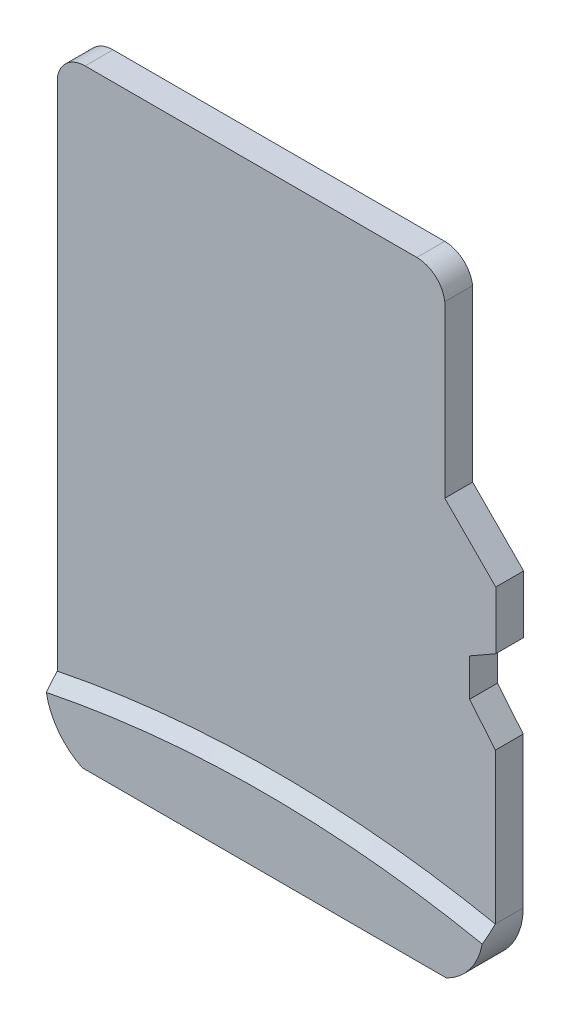
ISO-10303-21;
HEADER;
FILE_DESCRIPTION(('STEP AP214'),'2;1');
FILE_NAME('part.step','',(''),(''),'','','');
FILE_SCHEMA(('AUTOMOTIVE_DESIGN { 1 0 10303 214 1 1 1 1 }'));
ENDSEC;
DATA;
#1=APPLICATION_CONTEXT('core data for automotive mechanical design processes');
#2=APPLICATION_PROTOCOL_DEFINITION('international standard','automotive_design',2000,#1);
#3=PRODUCT_CONTEXT('',#1,'mechanical');
#4=PRODUCT('Part','Part','',(#3));
#5=PRODUCT_RELATED_PRODUCT_CATEGORY('part','',(#4));
#6=PRODUCT_DEFINITION_FORMATION('','',#4);
#7=PRODUCT_DEFINITION_CONTEXT('part definition',#1,'design');
#8=PRODUCT_DEFINITION('design','',#6,#7);
#9=PRODUCT_DEFINITION_SHAPE('','',#8);
#10=(LENGTH_UNIT() NAMED_UNIT(*) SI_UNIT(.MILLI.,.METRE.));
#11=(NAMED_UNIT(*) PLANE_ANGLE_UNIT() SI_UNIT($,.RADIAN.));
#12=(NAMED_UNIT(*) SI_UNIT($,.STERADIAN.) SOLID_ANGLE_UNIT());
#13=UNCERTAINTY_MEASURE_WITH_UNIT(LENGTH_MEASURE(1.E-05),#10,'distance_accuracy_value','');
#14=(GEOMETRIC_REPRESENTATION_CONTEXT(3) GLOBAL_UNCERTAINTY_ASSIGNED_CONTEXT((#13)) GLOBAL_UNIT_ASSIGNED_CONTEXT((#10,
#11,#12)) REPRESENTATION_CONTEXT('',''));
#15=CARTESIAN_POINT('',(0.,0.,0.));
#16=DIRECTION('',(0.,0.,1.));
#17=DIRECTION('',(1.,0.,0.));
#18=AXIS2_PLACEMENT_3D('',#15,#16,#17);
#19=CARTESIAN_POINT('',(23.959933723224,1.91827990787177,0.7));
#20=DIRECTION('',(0.,0.,1.));
#21=DIRECTION('',(1.,0.,0.));
#22=AXIS2_PLACEMENT_3D('',#19,#20,#21);
#23=PLANE('',#22);
#24=DIRECTION('',(2.81346803077018E-13,-1.,0.));
#25=VECTOR('',#24,1.);
#26=CARTESIAN_POINT('',(18.4539327369667,1.91827990787022,0.7));
#27=LINE('',#26,#25);
#28=CARTESIAN_POINT('',(18.4539327369607,23.4203809199612,0.7));
#29=VERTEX_POINT('',#28);
#30=CARTESIAN_POINT('',(18.4539327369643,10.5215618395466,0.7));
#31=VERTEX_POINT('',#30);
#32=EDGE_CURVE('E298',#29,#31,#27,.T.);
#33=ORIENTED_EDGE('',*,*,#32,.T.);
#34=CARTESIAN_POINT('',(23.9545115150179,-16.6696035780589,0.7));
#35=DIRECTION('',(0.,0.,1.));
#36=DIRECTION('',(1.,0.,0.));
#37=AXIS2_PLACEMENT_3D('',#34,#35,#36);
#38=CIRCLE('',#37,27.7419509707079);
#39=CARTESIAN_POINT('',(29.45509029309,10.5215618395429,0.7));
#40=VERTEX_POINT('',#39);
#41=EDGE_CURVE('E187',#31,#40,#38,.F.);
#42=ORIENTED_EDGE('',*,*,#41,.T.);
#43=DIRECTION('',(0.,-1.,0.));
#44=VECTOR('',#43,1.);
#45=CARTESIAN_POINT('',(29.45509029309,1.91827990787177,0.7));
#46=LINE('',#45,#44);
#47=CARTESIAN_POINT('',(29.45509029309,14.3034538287921,0.7));
#48=VERTEX_POINT('',#47);
#49=EDGE_CURVE('E300',#48,#40,#46,.T.);
#50=ORIENTED_EDGE('',*,*,#49,.F.);
#51=DIRECTION('',(0.635619317800836,-0.77200264432086,0.));
#52=VECTOR('',#51,1.);
#53=CARTESIAN_POINT('',(33.3123838453767,9.61850996555319,0.7));
#54=LINE('',#53,#52);
#55=CARTESIAN_POINT('',(28.8096789808155,15.0873495125709,0.7));
#56=VERTEX_POINT('',#55);
#57=EDGE_CURVE('E305',#56,#48,#54,.T.);
#58=ORIENTED_EDGE('',*,*,#57,.F.);
#59=DIRECTION('',(0.,-1.,0.));
#60=VECTOR('',#59,1.);
#61=CARTESIAN_POINT('',(28.8096789808155,1.91827990787177,0.7));
#62=LINE('',#61,#60);
#63=CARTESIAN_POINT('',(28.8096789808155,16.0307991680805,0.7));
#64=VERTEX_POINT('',#63);
#65=EDGE_CURVE('E312',#64,#56,#62,.T.);
#66=ORIENTED_EDGE('',*,*,#65,.F.);
#67=DIRECTION('',(0.868480025401258,0.495724162694366,0.));
#68=VECTOR('',#67,1.);
#69=CARTESIAN_POINT('',(19.075907988012,10.4748101595401,0.7));
#70=LINE('',#69,#68);
#71=CARTESIAN_POINT('',(29.4659653337916,16.4054042174787,0.7));
#72=VERTEX_POINT('',#71);
#73=EDGE_CURVE('E315',#64,#72,#70,.T.);
#74=ORIENTED_EDGE('',*,*,#73,.T.);
#75=DIRECTION('',(0.,-1.,0.));
#76=VECTOR('',#75,1.);
#77=CARTESIAN_POINT('',(29.4659653337916,1.91827990787177,0.7));
#78=LINE('',#77,#76);
#79=CARTESIAN_POINT('',(29.4659653337916,17.8560411369481,0.7));
#80=VERTEX_POINT('',#79);
#81=EDGE_CURVE('E174',#80,#72,#78,.T.);
#82=ORIENTED_EDGE('',*,*,#81,.F.);
#83=DIRECTION('',(0.704184265540735,-0.710017267511753,0.));
#84=VECTOR('',#83,1.);
#85=CARTESIAN_POINT('',(34.7042687489594,12.5743470417543,0.7));
#86=LINE('',#85,#84);
#87=CARTESIAN_POINT('',(28.1850891034887,19.147527308344,0.7));
#88=VERTEX_POINT('',#87);
#89=EDGE_CURVE('E160',#88,#80,#86,.T.);
#90=ORIENTED_EDGE('',*,*,#89,.F.);
#91=DIRECTION('',(-8.54196872922178E-13,-1.,0.));
#92=VECTOR('',#91,1.);
#93=CARTESIAN_POINT('',(28.185089103474,1.91827990786816,0.7));
#94=LINE('',#93,#92);
#95=CARTESIAN_POINT('',(28.1850891034923,23.4203809199116,0.7));
#96=VERTEX_POINT('',#95);
#97=EDGE_CURVE('E172',#96,#88,#94,.T.);
#98=ORIENTED_EDGE('',*,*,#97,.F.);
#99=CARTESIAN_POINT('',(27.4859645810288,23.3283197349789,0.7));
#100=DIRECTION('',(0.,0.,1.));
#101=DIRECTION('',(1.,0.,0.));
#102=AXIS2_PLACEMENT_3D('',#99,#100,#101);
#103=CIRCLE('',#102,0.705159811449334);
#104=CARTESIAN_POINT('',(27.4834451154169,24.0334750455159,0.7));
#105=VERTEX_POINT('',#104);
#106=EDGE_CURVE('E61',#96,#105,#103,.T.);
#107=ORIENTED_EDGE('',*,*,#106,.T.);
#108=DIRECTION('',(0.999999999999854,-5.40305386818244E-07,0.));
#109=VECTOR('',#108,1.);
#110=CARTESIAN_POINT('',(23.9599456721841,24.0334769492816,0.7));
#111=LINE('',#110,#109);
#112=CARTESIAN_POINT('',(19.1530572594242,24.0334795464693,0.7));
#113=VERTEX_POINT('',#112);
#114=EDGE_CURVE('E220',#113,#105,#111,.T.);
#115=ORIENTED_EDGE('',*,*,#114,.F.);
#116=CARTESIAN_POINT('',(19.1530572594242,23.3283197350216,0.7));
#117=DIRECTION('',(0.,0.,1.));
#118=DIRECTION('',(1.,0.,0.));
#119=AXIS2_PLACEMENT_3D('',#116,#117,#118);
#120=CIRCLE('',#119,0.705159811448242);
#121=EDGE_CURVE('E301',#113,#29,#120,.T.);
#122=ORIENTED_EDGE('',*,*,#121,.T.);
#123=EDGE_LOOP('',(#33,#42,#50,#58,#66,#74,#82,#90,#98,#107,#115,#122));
#124=FACE_BOUND('',#123,.T.);
#125=ADVANCED_FACE('F37',(#124),#23,.T.);
#126=CARTESIAN_POINT('',(23.9599456721841,24.0334769492816,0.7));
#127=DIRECTION('',(5.40305386818244E-07,0.999999999999854,0.));
#128=DIRECTION('',(-0.999999999999854,5.40305386818244E-07,0.));
#129=AXIS2_PLACEMENT_3D('',#126,#127,#128);
#130=PLANE('',#129);
#131=DIRECTION('',(0.999999999999854,-5.40305386818244E-07,0.));
#132=VECTOR('',#131,1.);
#133=CARTESIAN_POINT('',(23.9599456721841,24.0334769492816,0.));
#134=LINE('',#133,#132);
#135=CARTESIAN_POINT('',(19.1530572594242,24.0334795464693,0.));
#136=VERTEX_POINT('',#135);
#137=CARTESIAN_POINT('',(27.4834451154169,24.0334750455159,0.));
#138=VERTEX_POINT('',#137);
#139=EDGE_CURVE('E182',#136,#138,#134,.T.);
#140=ORIENTED_EDGE('',*,*,#139,.F.);
#141=DIRECTION('',(0.,0.,-1.));
#142=VECTOR('',#141,1.);
#143=CARTESIAN_POINT('',(19.1530572594242,24.0334795464693,0.7));
#144=LINE('',#143,#142);
#145=EDGE_CURVE('E11',#113,#136,#144,.T.);
#146=ORIENTED_EDGE('',*,*,#145,.F.);
#147=ORIENTED_EDGE('',*,*,#114,.T.);
#148=DIRECTION('',(0.,0.,-1.));
#149=VECTOR('',#148,1.);
#150=CARTESIAN_POINT('',(27.4834451154169,24.0334750455159,0.7));
#151=LINE('',#150,#149);
#152=EDGE_CURVE('E178',#105,#138,#151,.T.);
#153=ORIENTED_EDGE('',*,*,#152,.T.);
#154=EDGE_LOOP('',(#140,#146,#147,#153));
#155=FACE_BOUND('',#154,.T.);
#156=ADVANCED_FACE('F278',(#155),#130,.T.);
#157=CARTESIAN_POINT('',(19.1530572594242,23.3283197350216,0.7));
#158=DIRECTION('',(0.,0.,-1.));
#159=DIRECTION('',(-1.,0.,0.));
#160=AXIS2_PLACEMENT_3D('',#157,#158,#159);
#161=CYLINDRICAL_SURFACE('',#160,0.705159811448242);
#162=CARTESIAN_POINT('',(19.1530572594242,23.3283197350216,0.));
#163=DIRECTION('',(0.,0.,1.));
#164=DIRECTION('',(1.,0.,0.));
#165=AXIS2_PLACEMENT_3D('',#162,#163,#164);
#166=CIRCLE('',#165,0.705159811448242);
#167=CARTESIAN_POINT('',(18.4539327369607,23.4203809199612,0.));
#168=VERTEX_POINT('',#167);
#169=EDGE_CURVE('E186',#136,#168,#166,.T.);
#170=ORIENTED_EDGE('',*,*,#169,.T.);
#171=DIRECTION('',(0.,0.,-1.));
#172=VECTOR('',#171,1.);
#173=CARTESIAN_POINT('',(18.4539327369607,23.4203809199612,0.7));
#174=LINE('',#173,#172);
#175=EDGE_CURVE('E52',#29,#168,#174,.T.);
#176=ORIENTED_EDGE('',*,*,#175,.F.);
#177=ORIENTED_EDGE('',*,*,#121,.F.);
#178=ORIENTED_EDGE('',*,*,#145,.T.);
#179=EDGE_LOOP('',(#170,#176,#177,#178));
#180=FACE_BOUND('',#179,.T.);
#181=ADVANCED_FACE('F275',(#180),#161,.T.);
#182=CARTESIAN_POINT('',(18.4539327369667,1.91827990787022,0.7));
#183=DIRECTION('',(1.,2.81346803077018E-13,0.));
#184=DIRECTION('',(-2.81346803077018E-13,1.,0.));
#185=AXIS2_PLACEMENT_3D('',#182,#183,#184);
#186=PLANE('',#185);
#187=DIRECTION('',(2.81346803077018E-13,-1.,0.));
#188=VECTOR('',#187,1.);
#189=CARTESIAN_POINT('',(18.4539327369667,1.91827990787022,0.));
#190=LINE('',#189,#188);
#191=CARTESIAN_POINT('',(18.4539327369643,10.5215618395466,0.));
#192=VERTEX_POINT('',#191);
#193=EDGE_CURVE('E189',#168,#192,#190,.T.);
#194=ORIENTED_EDGE('',*,*,#193,.T.);
#195=DIRECTION('',(0.,0.,-1.));
#196=VECTOR('',#195,1.);
#197=CARTESIAN_POINT('',(18.4539327369643,10.5215618395466,0.7));
#198=LINE('',#197,#196);
#199=EDGE_CURVE('E241',#31,#192,#198,.T.);
#200=ORIENTED_EDGE('',*,*,#199,.F.);
#201=ORIENTED_EDGE('',*,*,#32,.F.);
#202=ORIENTED_EDGE('',*,*,#175,.T.);
#203=EDGE_LOOP('',(#194,#200,#201,#202));
#204=FACE_BOUND('',#203,.T.);
#205=ADVANCED_FACE('F271',(#204),#186,.F.);
#206=CARTESIAN_POINT('',(20.0948226540754,10.5115367125023,0.7));
#207=DIRECTION('',(0.,0.,-1.));
#208=DIRECTION('',(-1.,0.,0.));
#209=AXIS2_PLACEMENT_3D('',#206,#207,#208);
#210=CYLINDRICAL_SURFACE('',#209,1.64092054141899);
#211=CARTESIAN_POINT('',(20.0948226540754,10.5115367125023,0.));
#212=DIRECTION('',(0.,0.,1.));
#213=DIRECTION('',(1.,0.,0.));
#214=AXIS2_PLACEMENT_3D('',#211,#212,#213);
#215=CIRCLE('',#214,1.64092054141899);
#216=CARTESIAN_POINT('',(19.3820795486301,9.033491554568,0.));
#217=VERTEX_POINT('',#216);
#218=EDGE_CURVE('E191',#192,#217,#215,.T.);
#219=ORIENTED_EDGE('',*,*,#218,.T.);
#220=DIRECTION('',(0.,0.,-1.));
#221=VECTOR('',#220,1.);
#222=CARTESIAN_POINT('',(19.3820795486301,9.033491554568,0.7));
#223=LINE('',#222,#221);
#224=CARTESIAN_POINT('',(19.3820795486301,9.033491554568,1.));
#225=VERTEX_POINT('',#224);
#226=EDGE_CURVE('E237',#225,#217,#223,.T.);
#227=ORIENTED_EDGE('',*,*,#226,.F.);
#228=CARTESIAN_POINT('',(20.0948226540753,10.511536712501,1.));
#229=DIRECTION('',(0.,0.,1.));
#230=DIRECTION('',(-1.,0.,0.));
#231=AXIS2_PLACEMENT_3D('',#228,#229,#230);
#232=CIRCLE('',#231,1.64092054141835);
#233=CARTESIAN_POINT('',(18.4798795363341,10.2207121095025,1.));
#234=VERTEX_POINT('',#233);
#235=EDGE_CURVE('E249',#234,#225,#232,.T.);
#236=ORIENTED_EDGE('',*,*,#235,.F.);
#237=CARTESIAN_POINT('',(18.4798795363341,10.2207121095025,1.));
#238=CARTESIAN_POINT('',(18.4709542851157,10.2701930916234,0.949735408039186));
#239=CARTESIAN_POINT('',(18.4643294262255,10.3200043935154,0.899603112064133));
#240=CARTESIAN_POINT('',(18.4556804931001,10.4202876368632,0.799603112064017));
#241=CARTESIAN_POINT('',(18.4536564188668,10.4707595783192,0.749735408039069));
#242=CARTESIAN_POINT('',(18.4539327369638,10.5215618395465,0.699999999999996));
#243=B_SPLINE_CURVE_WITH_KNOTS('',3,(#237,#238,#239,#240,#241,#242),.UNSPECIFIED.,.F.,.F.,(4,2,
4),(0.,0.212942985000667,0.425885970093028),.UNSPECIFIED.);
#244=EDGE_CURVE('E42',#234,#31,#243,.T.);
#245=ORIENTED_EDGE('',*,*,#244,.T.);
#246=ORIENTED_EDGE('',*,*,#199,.T.);
#247=EDGE_LOOP('',(#219,#227,#236,#245,#246));
#248=FACE_BOUND('',#247,.T.);
#249=ADVANCED_FACE('F267',(#248),#210,.T.);
#250=CARTESIAN_POINT('',(23.9599337232889,9.03349155452627,0.7));
#251=DIRECTION('',(9.11516377739171E-12,1.,0.));
#252=DIRECTION('',(-1.,9.11516377739171E-12,0.));
#253=AXIS2_PLACEMENT_3D('',#250,#251,#252);
#254=PLANE('',#253);
#255=DIRECTION('',(1.,-9.11516377739171E-12,0.));
#256=VECTOR('',#255,1.);
#257=CARTESIAN_POINT('',(23.9599337232889,9.03349155452627,0.));
#258=LINE('',#257,#256);
#259=CARTESIAN_POINT('',(28.526943481233,9.03349155448464,0.));
#260=VERTEX_POINT('',#259);
#261=EDGE_CURVE('E193',#217,#260,#258,.T.);
#262=ORIENTED_EDGE('',*,*,#261,.T.);
#263=DIRECTION('',(0.,0.,-1.));
#264=VECTOR('',#263,1.);
#265=CARTESIAN_POINT('',(28.526943481233,9.03349155448464,0.7));
#266=LINE('',#265,#264);
#267=CARTESIAN_POINT('',(28.526943481233,9.03349155448464,1.));
#268=VERTEX_POINT('',#267);
#269=EDGE_CURVE('E125',#268,#260,#266,.T.);
#270=ORIENTED_EDGE('',*,*,#269,.F.);
#271=DIRECTION('',(1.,-9.11516377739171E-12,0.));
#272=VECTOR('',#271,1.);
#273=CARTESIAN_POINT('',(19.3820795486301,9.033491554568,1.));
#274=LINE('',#273,#272);
#275=EDGE_CURVE('E248',#225,#268,#274,.T.);
#276=ORIENTED_EDGE('',*,*,#275,.F.);
#277=ORIENTED_EDGE('',*,*,#226,.T.);
#278=EDGE_LOOP('',(#262,#270,#276,#277));
#279=FACE_BOUND('',#278,.T.);
#280=ADVANCED_FACE('F263',(#279),#254,.F.);
#281=CARTESIAN_POINT('',(27.7888285020603,10.5273617875264,0.7));
#282=DIRECTION('',(0.,0.,-1.));
#283=DIRECTION('',(-1.,0.,0.));
#284=AXIS2_PLACEMENT_3D('',#281,#282,#283);
#285=CYLINDRICAL_SURFACE('',#284,1.66627188527104);
#286=CARTESIAN_POINT('',(27.7888285020603,10.5273617875264,0.));
#287=DIRECTION('',(0.,0.,1.));
#288=DIRECTION('',(1.,0.,0.));
#289=AXIS2_PLACEMENT_3D('',#286,#287,#288);
#290=CIRCLE('',#289,1.66627188527104);
#291=CARTESIAN_POINT('',(29.45509029309,10.5215618395429,0.));
#292=VERTEX_POINT('',#291);
#293=EDGE_CURVE('E195',#260,#292,#290,.T.);
#294=ORIENTED_EDGE('',*,*,#293,.T.);
#295=DIRECTION('',(0.,0.,-1.));
#296=VECTOR('',#295,1.);
#297=CARTESIAN_POINT('',(29.45509029309,10.5215618395429,0.7));
#298=LINE('',#297,#296);
#299=EDGE_CURVE('E232',#40,#292,#298,.T.);
#300=ORIENTED_EDGE('',*,*,#299,.F.);
#301=CARTESIAN_POINT('',(29.2537860070381,9.7334087005911,1.51238789351859));
#302=CARTESIAN_POINT('',(29.2803801731756,9.78251047923255,1.45901144865288));
#303=CARTESIAN_POINT('',(29.3043177233163,9.83253824211502,1.40523804850298));
#304=CARTESIAN_POINT('',(29.3469379449529,9.93422600016491,1.29711943171935));
#305=CARTESIAN_POINT('',(29.3656190381277,9.98588648040922,1.24277404841069));
#306=CARTESIAN_POINT('',(29.4134321716254,10.1416018398551,1.08065709052752));
#307=CARTESIAN_POINT('',(29.4350107566258,10.2476605123627,0.972425538884719));
#308=CARTESIAN_POINT('',(29.4490375362642,10.3826825061088,0.83731364337082));
#309=CARTESIAN_POINT('',(29.4512137993634,10.410286147514,0.809829245481));
#310=CARTESIAN_POINT('',(29.4541932084279,10.4657536303997,0.754876564047817));
#311=CARTESIAN_POINT('',(29.454992069985,10.4936180136675,0.727408595503557));
#312=CARTESIAN_POINT('',(29.4550902930909,10.5215618395428,0.699999999999919));
#313=B_SPLINE_CURVE_WITH_KNOTS('',3,(#301,#302,#303,#304,#305,#306,#307,#308,#309,#310,#311,
#312),.UNSPECIFIED.,.F.,.F.,(4,2,2,2,2,4),(0.,0.231595135453855,0.46325973639887,
0.920658272538868,1.03768812061169,1.15508133777267),.UNSPECIFIED.);
#314=CARTESIAN_POINT('',(29.4267322637467,10.2212029021476,1.));
#315=VERTEX_POINT('',#314);
#316=EDGE_CURVE('E252',#315,#40,#313,.T.);
#317=ORIENTED_EDGE('',*,*,#316,.F.);
#318=CARTESIAN_POINT('',(27.7888285020592,10.5273617875253,1.));
#319=DIRECTION('',(0.,0.,1.));
#320=DIRECTION('',(-1.,0.,0.));
#321=AXIS2_PLACEMENT_3D('',#318,#319,#320);
#322=CIRCLE('',#321,1.66627188527133);
#323=EDGE_CURVE('E117',#268,#315,#322,.T.);
#324=ORIENTED_EDGE('',*,*,#323,.F.);
#325=ORIENTED_EDGE('',*,*,#269,.T.);
#326=EDGE_LOOP('',(#294,#300,#317,#324,#325));
#327=FACE_BOUND('',#326,.T.);
#328=ADVANCED_FACE('F257',(#327),#285,.T.);
#329=CARTESIAN_POINT('',(29.45509029309,1.91827990787177,0.7));
#330=DIRECTION('',(1.,0.,0.));
#331=DIRECTION('',(0.,0.,-1.));
#332=AXIS2_PLACEMENT_3D('',#329,#330,#331);
#333=PLANE('',#332);
#334=DIRECTION('',(0.,-1.,0.));
#335=VECTOR('',#334,1.);
#336=CARTESIAN_POINT('',(29.45509029309,1.91827990787177,0.));
#337=LINE('',#336,#335);
#338=CARTESIAN_POINT('',(29.45509029309,14.3034538287921,0.));
#339=VERTEX_POINT('',#338);
#340=EDGE_CURVE('E198',#339,#292,#337,.T.);
#341=ORIENTED_EDGE('',*,*,#340,.F.);
#342=DIRECTION('',(0.,0.,-1.));
#343=VECTOR('',#342,1.);
#344=CARTESIAN_POINT('',(29.45509029309,14.3034538287921,0.7));
#345=LINE('',#344,#343);
#346=EDGE_CURVE('E230',#48,#339,#345,.T.);
#347=ORIENTED_EDGE('',*,*,#346,.F.);
#348=ORIENTED_EDGE('',*,*,#49,.T.);
#349=ORIENTED_EDGE('',*,*,#299,.T.);
#350=EDGE_LOOP('',(#341,#347,#348,#349));
#351=FACE_BOUND('',#350,.T.);
#352=ADVANCED_FACE('F262',(#351),#333,.T.);
#353=CARTESIAN_POINT('',(33.3123838453767,9.61850996555319,0.7));
#354=DIRECTION('',(0.77200264432086,0.635619317800836,0.));
#355=DIRECTION('',(-0.635619317800836,0.77200264432086,0.));
#356=AXIS2_PLACEMENT_3D('',#353,#354,#355);
#357=PLANE('',#356);
#358=DIRECTION('',(0.635619317800836,-0.77200264432086,0.));
#359=VECTOR('',#358,1.);
#360=CARTESIAN_POINT('',(33.3123838453767,9.61850996555319,0.));
#361=LINE('',#360,#359);
#362=CARTESIAN_POINT('',(28.8096789808155,15.0873495125709,0.));
#363=VERTEX_POINT('',#362);
#364=EDGE_CURVE('E202',#363,#339,#361,.T.);
#365=ORIENTED_EDGE('',*,*,#364,.F.);
#366=DIRECTION('',(0.,0.,-1.));
#367=VECTOR('',#366,1.);
#368=CARTESIAN_POINT('',(28.8096789808155,15.0873495125709,0.7));
#369=LINE('',#368,#367);
#370=EDGE_CURVE('E228',#56,#363,#369,.T.);
#371=ORIENTED_EDGE('',*,*,#370,.F.);
#372=ORIENTED_EDGE('',*,*,#57,.T.);
#373=ORIENTED_EDGE('',*,*,#346,.T.);
#374=EDGE_LOOP('',(#365,#371,#372,#373));
#375=FACE_BOUND('',#374,.T.);
#376=ADVANCED_FACE('F330',(#375),#357,.T.);
#377=CARTESIAN_POINT('',(28.8096789808155,1.91827990787177,0.7));
#378=DIRECTION('',(1.,0.,0.));
#379=DIRECTION('',(0.,0.,-1.));
#380=AXIS2_PLACEMENT_3D('',#377,#378,#379);
#381=PLANE('',#380);
#382=DIRECTION('',(0.,-1.,0.));
#383=VECTOR('',#382,1.);
#384=CARTESIAN_POINT('',(28.8096789808155,1.91827990787177,0.));
#385=LINE('',#384,#383);
#386=CARTESIAN_POINT('',(28.8096789808155,16.0307991680805,0.));
#387=VERTEX_POINT('',#386);
#388=EDGE_CURVE('E205',#387,#363,#385,.T.);
#389=ORIENTED_EDGE('',*,*,#388,.F.);
#390=DIRECTION('',(0.,0.,-1.));
#391=VECTOR('',#390,1.);
#392=CARTESIAN_POINT('',(28.8096789808155,16.0307991680805,0.7));
#393=LINE('',#392,#391);
#394=EDGE_CURVE('E226',#64,#387,#393,.T.);
#395=ORIENTED_EDGE('',*,*,#394,.F.);
#396=ORIENTED_EDGE('',*,*,#65,.T.);
#397=ORIENTED_EDGE('',*,*,#370,.T.);
#398=EDGE_LOOP('',(#389,#395,#396,#397));
#399=FACE_BOUND('',#398,.T.);
#400=ADVANCED_FACE('F324',(#399),#381,.T.);
#401=CARTESIAN_POINT('',(19.075907988012,10.4748101595401,0.7));
#402=DIRECTION('',(-0.495724162694366,0.868480025401258,0.));
#403=DIRECTION('',(-0.868480025401258,-0.495724162694366,0.));
#404=AXIS2_PLACEMENT_3D('',#401,#402,#403);
#405=PLANE('',#404);
#406=DIRECTION('',(0.868480025401258,0.495724162694366,0.));
#407=VECTOR('',#406,1.);
#408=CARTESIAN_POINT('',(19.075907988012,10.4748101595401,0.));
#409=LINE('',#408,#407);
#410=CARTESIAN_POINT('',(29.4659653337916,16.4054042174787,0.));
#411=VERTEX_POINT('',#410);
#412=EDGE_CURVE('E208',#387,#411,#409,.T.);
#413=ORIENTED_EDGE('',*,*,#412,.T.);
#414=DIRECTION('',(0.,0.,-1.));
#415=VECTOR('',#414,1.);
#416=CARTESIAN_POINT('',(29.4659653337916,16.4054042174787,0.7));
#417=LINE('',#416,#415);
#418=EDGE_CURVE('E224',#72,#411,#417,.T.);
#419=ORIENTED_EDGE('',*,*,#418,.F.);
#420=ORIENTED_EDGE('',*,*,#73,.F.);
#421=ORIENTED_EDGE('',*,*,#394,.T.);
#422=EDGE_LOOP('',(#413,#419,#420,#421));
#423=FACE_BOUND('',#422,.T.);
#424=ADVANCED_FACE('F355',(#423),#405,.F.);
#425=CARTESIAN_POINT('',(29.4659653337916,1.91827990787177,0.7));
#426=DIRECTION('',(1.,0.,0.));
#427=DIRECTION('',(0.,0.,-1.));
#428=AXIS2_PLACEMENT_3D('',#425,#426,#427);
#429=PLANE('',#428);
#430=DIRECTION('',(0.,-1.,0.));
#431=VECTOR('',#430,1.);
#432=CARTESIAN_POINT('',(29.4659653337916,1.91827990787177,0.));
#433=LINE('',#432,#431);
#434=CARTESIAN_POINT('',(29.4659653337916,17.8560411369481,0.));
#435=VERTEX_POINT('',#434);
#436=EDGE_CURVE('E211',#435,#411,#433,.T.);
#437=ORIENTED_EDGE('',*,*,#436,.F.);
#438=DIRECTION('',(0.,0.,-1.));
#439=VECTOR('',#438,1.);
#440=CARTESIAN_POINT('',(29.4659653337916,17.8560411369481,0.7));
#441=LINE('',#440,#439);
#442=EDGE_CURVE('E167',#80,#435,#441,.T.);
#443=ORIENTED_EDGE('',*,*,#442,.F.);
#444=ORIENTED_EDGE('',*,*,#81,.T.);
#445=ORIENTED_EDGE('',*,*,#418,.T.);
#446=EDGE_LOOP('',(#437,#443,#444,#445));
#447=FACE_BOUND('',#446,.T.);
#448=ADVANCED_FACE('F318',(#447),#429,.T.);
#449=CARTESIAN_POINT('',(34.7042687489594,12.5743470417543,0.7));
#450=DIRECTION('',(0.710017267511753,0.704184265540735,0.));
#451=DIRECTION('',(-0.704184265540735,0.710017267511753,0.));
#452=AXIS2_PLACEMENT_3D('',#449,#450,#451);
#453=PLANE('',#452);
#454=DIRECTION('',(0.704184265540735,-0.710017267511753,0.));
#455=VECTOR('',#454,1.);
#456=CARTESIAN_POINT('',(34.7042687489594,12.5743470417543,0.));
#457=LINE('',#456,#455);
#458=CARTESIAN_POINT('',(28.1850891034887,19.147527308344,0.));
#459=VERTEX_POINT('',#458);
#460=EDGE_CURVE('E162',#459,#435,#457,.T.);
#461=ORIENTED_EDGE('',*,*,#460,.F.);
#462=DIRECTION('',(0.,0.,-1.));
#463=VECTOR('',#462,1.);
#464=CARTESIAN_POINT('',(28.1850891034887,19.147527308344,0.7));
#465=LINE('',#464,#463);
#466=EDGE_CURVE('E157',#88,#459,#465,.T.);
#467=ORIENTED_EDGE('',*,*,#466,.F.);
#468=ORIENTED_EDGE('',*,*,#89,.T.);
#469=ORIENTED_EDGE('',*,*,#442,.T.);
#470=EDGE_LOOP('',(#461,#467,#468,#469));
#471=FACE_BOUND('',#470,.T.);
#472=ADVANCED_FACE('F159',(#471),#453,.T.);
#473=CARTESIAN_POINT('',(28.185089103474,1.91827990786816,0.7));
#474=DIRECTION('',(1.,-8.54196872922178E-13,0.));
#475=DIRECTION('',(8.54196872922178E-13,1.,0.));
#476=AXIS2_PLACEMENT_3D('',#473,#474,#475);
#477=PLANE('',#476);
#478=DIRECTION('',(-8.54196872922178E-13,-1.,0.));
#479=VECTOR('',#478,1.);
#480=CARTESIAN_POINT('',(28.185089103474,1.91827990786816,0.));
#481=LINE('',#480,#479);
#482=CARTESIAN_POINT('',(28.1850891034923,23.4203809199116,0.));
#483=VERTEX_POINT('',#482);
#484=EDGE_CURVE('E215',#483,#459,#481,.T.);
#485=ORIENTED_EDGE('',*,*,#484,.F.);
#486=DIRECTION('',(0.,0.,-1.));
#487=VECTOR('',#486,1.);
#488=CARTESIAN_POINT('',(28.1850891034923,23.4203809199116,0.7));
#489=LINE('',#488,#487);
#490=EDGE_CURVE('E168',#96,#483,#489,.T.);
#491=ORIENTED_EDGE('',*,*,#490,.F.);
#492=ORIENTED_EDGE('',*,*,#97,.T.);
#493=ORIENTED_EDGE('',*,*,#466,.T.);
#494=EDGE_LOOP('',(#485,#491,#492,#493));
#495=FACE_BOUND('',#494,.T.);
#496=ADVANCED_FACE('F176',(#495),#477,.T.);
#497=CARTESIAN_POINT('',(27.4859645810288,23.3283197349789,0.7));
#498=DIRECTION('',(0.,0.,-1.));
#499=DIRECTION('',(-1.,0.,0.));
#500=AXIS2_PLACEMENT_3D('',#497,#498,#499);
#501=CYLINDRICAL_SURFACE('',#500,0.705159811449334);
#502=CARTESIAN_POINT('',(27.4859645810288,23.3283197349789,0.));
#503=DIRECTION('',(0.,0.,1.));
#504=DIRECTION('',(1.,0.,0.));
#505=AXIS2_PLACEMENT_3D('',#502,#503,#504);
#506=CIRCLE('',#505,0.705159811449334);
#507=EDGE_CURVE('E217',#483,#138,#506,.T.);
#508=ORIENTED_EDGE('',*,*,#507,.T.);
#509=ORIENTED_EDGE('',*,*,#152,.F.);
#510=ORIENTED_EDGE('',*,*,#106,.F.);
#511=ORIENTED_EDGE('',*,*,#490,.T.);
#512=EDGE_LOOP('',(#508,#509,#510,#511));
#513=FACE_BOUND('',#512,.T.);
#514=ADVANCED_FACE('F432',(#513),#501,.T.);
#515=CARTESIAN_POINT('',(23.959933723224,1.91827990787177,0.));
#516=DIRECTION('',(0.,0.,1.));
#517=DIRECTION('',(1.,0.,0.));
#518=AXIS2_PLACEMENT_3D('',#515,#516,#517);
#519=PLANE('',#518);
#520=ORIENTED_EDGE('',*,*,#218,.F.);
#521=ORIENTED_EDGE('',*,*,#193,.F.);
#522=ORIENTED_EDGE('',*,*,#169,.F.);
#523=ORIENTED_EDGE('',*,*,#139,.T.);
#524=ORIENTED_EDGE('',*,*,#507,.F.);
#525=ORIENTED_EDGE('',*,*,#484,.T.);
#526=ORIENTED_EDGE('',*,*,#460,.T.);
#527=ORIENTED_EDGE('',*,*,#436,.T.);
#528=ORIENTED_EDGE('',*,*,#412,.F.);
#529=ORIENTED_EDGE('',*,*,#388,.T.);
#530=ORIENTED_EDGE('',*,*,#364,.T.);
#531=ORIENTED_EDGE('',*,*,#340,.T.);
#532=ORIENTED_EDGE('',*,*,#293,.F.);
#533=ORIENTED_EDGE('',*,*,#261,.F.);
#534=EDGE_LOOP('',(#520,#521,#522,#523,#524,#525,#526,#527,#528,#529,#530,#531,#532,#533));
#535=FACE_BOUND('',#534,.T.);
#536=ADVANCED_FACE('F293',(#535),#519,.F.);
#537=CARTESIAN_POINT('',(23.9545115150179,-16.6696035780589,0.7));
#538=DIRECTION('',(0.,0.,-1.));
#539=DIRECTION('',(1.,0.,0.));
#540=AXIS2_PLACEMENT_3D('',#537,#538,#539);
#541=CONICAL_SURFACE('',#540,27.7419509707079,0.78539816339745);
#542=ORIENTED_EDGE('',*,*,#41,.F.);
#543=ORIENTED_EDGE('',*,*,#244,.F.);
#544=CARTESIAN_POINT('',(23.9545115150179,-16.6696035780589,1.));
#545=DIRECTION('',(0.,0.,-1.));
#546=DIRECTION('',(-1.,0.,0.));
#547=AXIS2_PLACEMENT_3D('',#544,#545,#546);
#548=CIRCLE('',#547,27.4419509707079);
#549=EDGE_CURVE('E247',#315,#234,#548,.F.);
#550=ORIENTED_EDGE('',*,*,#549,.F.);
#551=ORIENTED_EDGE('',*,*,#316,.T.);
#552=EDGE_LOOP('',(#542,#543,#550,#551));
#553=FACE_BOUND('',#552,.T.);
#554=ADVANCED_FACE('F39',(#553),#541,.T.);
#555=CARTESIAN_POINT('',(20.0948226540753,10.511536712501,1.));
#556=DIRECTION('',(0.,0.,-1.));
#557=DIRECTION('',(-1.,0.,0.));
#558=AXIS2_PLACEMENT_3D('',#555,#556,#557);
#559=PLANE('',#558);
#560=ORIENTED_EDGE('',*,*,#235,.T.);
#561=ORIENTED_EDGE('',*,*,#275,.T.);
#562=ORIENTED_EDGE('',*,*,#323,.T.);
#563=ORIENTED_EDGE('',*,*,#549,.T.);
#564=EDGE_LOOP('',(#560,#561,#562,#563));
#565=FACE_BOUND('',#564,.T.);
#566=ADVANCED_FACE('F345',(#565),#559,.F.);
#567=CLOSED_SHELL('',(#125,#156,#181,#205,#249,#280,#328,#352,#376,#400,#424,#448,#472,#496,
#514,#536,#554,#566));
#568=MANIFOLD_SOLID_BREP('B2',#567);
#569=ADVANCED_BREP_SHAPE_REPRESENTATION('',(#18,#568),#14);
#570=SHAPE_DEFINITION_REPRESENTATION(#9,#569);
ENDSEC;
END-ISO-10303-21;
